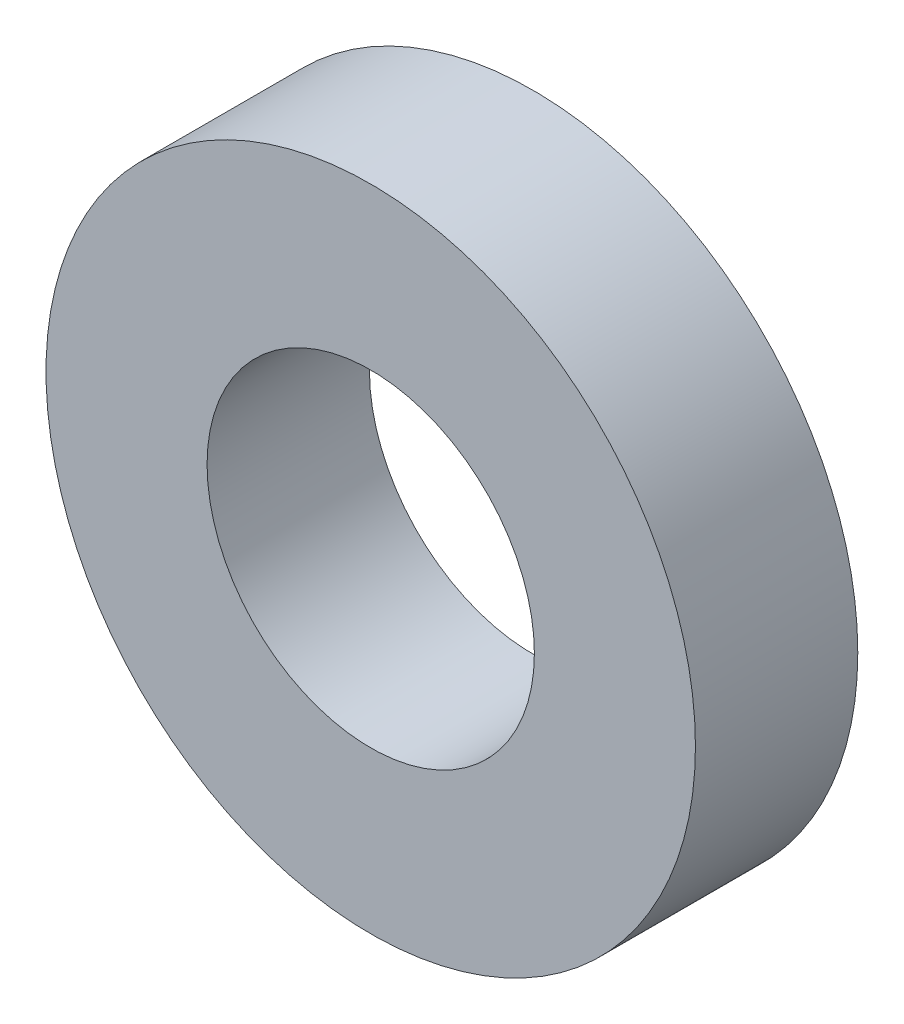
ISO-10303-21;
HEADER;
FILE_DESCRIPTION(('STEP AP214'),'2;1');
FILE_NAME('part.step','',(''),(''),'','','');
FILE_SCHEMA(('AUTOMOTIVE_DESIGN { 1 0 10303 214 1 1 1 1 }'));
ENDSEC;
DATA;
#1=APPLICATION_CONTEXT('core data for automotive mechanical design processes');
#2=APPLICATION_PROTOCOL_DEFINITION('international standard','automotive_design',2000,#1);
#3=PRODUCT_CONTEXT('',#1,'mechanical');
#4=PRODUCT('Part','Part','',(#3));
#5=PRODUCT_RELATED_PRODUCT_CATEGORY('part','',(#4));
#6=PRODUCT_DEFINITION_FORMATION('','',#4);
#7=PRODUCT_DEFINITION_CONTEXT('part definition',#1,'design');
#8=PRODUCT_DEFINITION('design','',#6,#7);
#9=PRODUCT_DEFINITION_SHAPE('','',#8);
#10=(LENGTH_UNIT() NAMED_UNIT(*) SI_UNIT(.MILLI.,.METRE.));
#11=(NAMED_UNIT(*) PLANE_ANGLE_UNIT() SI_UNIT($,.RADIAN.));
#12=(NAMED_UNIT(*) SI_UNIT($,.STERADIAN.) SOLID_ANGLE_UNIT());
#13=UNCERTAINTY_MEASURE_WITH_UNIT(LENGTH_MEASURE(1.E-05),#10,'distance_accuracy_value','');
#14=(GEOMETRIC_REPRESENTATION_CONTEXT(3) GLOBAL_UNCERTAINTY_ASSIGNED_CONTEXT((#13)) GLOBAL_UNIT_ASSIGNED_CONTEXT((#10,
#11,#12)) REPRESENTATION_CONTEXT('',''));
#15=CARTESIAN_POINT('',(0.,0.,0.));
#16=DIRECTION('',(0.,0.,1.));
#17=DIRECTION('',(1.,0.,0.));
#18=AXIS2_PLACEMENT_3D('',#15,#16,#17);
#19=CARTESIAN_POINT('',(0.,0.,1.5875));
#20=DIRECTION('',(0.,0.,1.));
#21=DIRECTION('',(1.,0.,0.));
#22=AXIS2_PLACEMENT_3D('',#19,#20,#21);
#23=PLANE('',#22);
#24=CARTESIAN_POINT('',(0.,0.,1.5875));
#25=DIRECTION('',(0.,0.,1.));
#26=DIRECTION('',(1.,0.,0.));
#27=AXIS2_PLACEMENT_3D('',#24,#25,#26);
#28=CIRCLE('',#27,6.35);
#29=CARTESIAN_POINT('',(6.35,0.,1.5875));
#30=VERTEX_POINT('',#29);
#31=EDGE_CURVE('E10',#30,#30,#28,.T.);
#32=ORIENTED_EDGE('',*,*,#31,.T.);
#33=EDGE_LOOP('',(#32));
#34=FACE_BOUND('',#33,.T.);
#35=CARTESIAN_POINT('',(0.,0.,1.5875));
#36=DIRECTION('',(0.,0.,1.));
#37=DIRECTION('',(1.,0.,0.));
#38=AXIS2_PLACEMENT_3D('',#35,#36,#37);
#39=CIRCLE('',#38,3.2004);
#40=CARTESIAN_POINT('',(3.2004,0.,1.5875));
#41=VERTEX_POINT('',#40);
#42=EDGE_CURVE('E41',#41,#41,#39,.T.);
#43=ORIENTED_EDGE('',*,*,#42,.F.);
#44=EDGE_LOOP('',(#43));
#45=FACE_BOUND('',#44,.T.);
#46=ADVANCED_FACE('F30',(#34,#45),#23,.T.);
#47=CARTESIAN_POINT('',(0.,0.,-1.5875));
#48=DIRECTION('',(0.,0.,1.));
#49=DIRECTION('',(1.,0.,0.));
#50=AXIS2_PLACEMENT_3D('',#47,#48,#49);
#51=PLANE('',#50);
#52=CARTESIAN_POINT('',(0.,0.,-1.5875));
#53=DIRECTION('',(0.,0.,1.));
#54=DIRECTION('',(1.,0.,0.));
#55=AXIS2_PLACEMENT_3D('',#52,#53,#54);
#56=CIRCLE('',#55,6.35);
#57=CARTESIAN_POINT('',(6.35,0.,-1.5875));
#58=VERTEX_POINT('',#57);
#59=EDGE_CURVE('E34',#58,#58,#56,.T.);
#60=ORIENTED_EDGE('',*,*,#59,.F.);
#61=EDGE_LOOP('',(#60));
#62=FACE_BOUND('',#61,.T.);
#63=CARTESIAN_POINT('',(0.,0.,-1.5875));
#64=DIRECTION('',(0.,0.,1.));
#65=DIRECTION('',(1.,0.,0.));
#66=AXIS2_PLACEMENT_3D('',#63,#64,#65);
#67=CIRCLE('',#66,3.2004);
#68=CARTESIAN_POINT('',(3.2004,0.,-1.5875));
#69=VERTEX_POINT('',#68);
#70=EDGE_CURVE('E43',#69,#69,#67,.T.);
#71=ORIENTED_EDGE('',*,*,#70,.T.);
#72=EDGE_LOOP('',(#71));
#73=FACE_BOUND('',#72,.T.);
#74=ADVANCED_FACE('F53',(#62,#73),#51,.F.);
#75=CARTESIAN_POINT('',(0.,0.,1.5875));
#76=DIRECTION('',(0.,0.,-1.));
#77=DIRECTION('',(-1.,0.,0.));
#78=AXIS2_PLACEMENT_3D('',#75,#76,#77);
#79=CYLINDRICAL_SURFACE('',#78,6.35);
#80=ORIENTED_EDGE('',*,*,#31,.F.);
#81=EDGE_LOOP('',(#80));
#82=FACE_BOUND('',#81,.T.);
#83=ORIENTED_EDGE('',*,*,#59,.T.);
#84=EDGE_LOOP('',(#83));
#85=FACE_BOUND('',#84,.T.);
#86=ADVANCED_FACE('F32',(#82,#85),#79,.T.);
#87=CARTESIAN_POINT('',(0.,0.,1.5875));
#88=DIRECTION('',(0.,0.,-1.));
#89=DIRECTION('',(-1.,0.,0.));
#90=AXIS2_PLACEMENT_3D('',#87,#88,#89);
#91=CYLINDRICAL_SURFACE('',#90,3.2004);
#92=ORIENTED_EDGE('',*,*,#42,.T.);
#93=EDGE_LOOP('',(#92));
#94=FACE_BOUND('',#93,.T.);
#95=ORIENTED_EDGE('',*,*,#70,.F.);
#96=EDGE_LOOP('',(#95));
#97=FACE_BOUND('',#96,.T.);
#98=ADVANCED_FACE('F49',(#94,#97),#91,.F.);
#99=CLOSED_SHELL('',(#46,#74,#86,#98));
#100=MANIFOLD_SOLID_BREP('B2',#99);
#101=ADVANCED_BREP_SHAPE_REPRESENTATION('',(#18,#100),#14);
#102=SHAPE_DEFINITION_REPRESENTATION(#9,#101);
ENDSEC;
END-ISO-10303-21;
